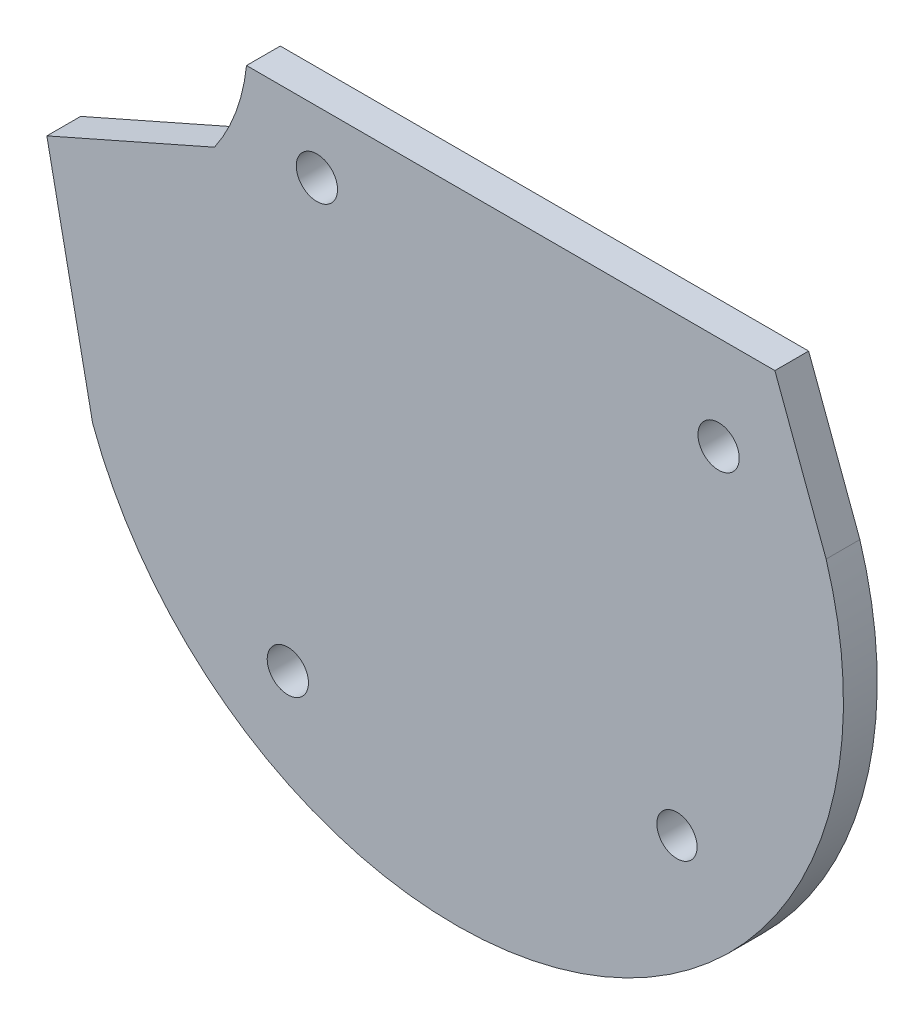
ISO-10303-21;
HEADER;
FILE_DESCRIPTION(('STEP AP214'),'2;1');
FILE_NAME('part.step','',(''),(''),'','','');
FILE_SCHEMA(('AUTOMOTIVE_DESIGN { 1 0 10303 214 1 1 1 1 }'));
ENDSEC;
DATA;
#1=APPLICATION_CONTEXT('core data for automotive mechanical design processes');
#2=APPLICATION_PROTOCOL_DEFINITION('international standard','automotive_design',2000,#1);
#3=PRODUCT_CONTEXT('',#1,'mechanical');
#4=PRODUCT('Part','Part','',(#3));
#5=PRODUCT_RELATED_PRODUCT_CATEGORY('part','',(#4));
#6=PRODUCT_DEFINITION_FORMATION('','',#4);
#7=PRODUCT_DEFINITION_CONTEXT('part definition',#1,'design');
#8=PRODUCT_DEFINITION('design','',#6,#7);
#9=PRODUCT_DEFINITION_SHAPE('','',#8);
#10=(LENGTH_UNIT() NAMED_UNIT(*) SI_UNIT(.MILLI.,.METRE.));
#11=(NAMED_UNIT(*) PLANE_ANGLE_UNIT() SI_UNIT($,.RADIAN.));
#12=(NAMED_UNIT(*) SI_UNIT($,.STERADIAN.) SOLID_ANGLE_UNIT());
#13=UNCERTAINTY_MEASURE_WITH_UNIT(LENGTH_MEASURE(1.E-05),#10,'distance_accuracy_value','');
#14=(GEOMETRIC_REPRESENTATION_CONTEXT(3) GLOBAL_UNCERTAINTY_ASSIGNED_CONTEXT((#13)) GLOBAL_UNIT_ASSIGNED_CONTEXT((#10,
#11,#12)) REPRESENTATION_CONTEXT('',''));
#15=CARTESIAN_POINT('',(0.,0.,0.));
#16=DIRECTION('',(0.,0.,1.));
#17=DIRECTION('',(1.,0.,0.));
#18=AXIS2_PLACEMENT_3D('',#15,#16,#17);
#19=CARTESIAN_POINT('',(3.9740812322332,17.199431679907,-2.286));
#20=DIRECTION('',(0.,0.,-1.));
#21=DIRECTION('',(-1.,0.,0.));
#22=AXIS2_PLACEMENT_3D('',#19,#20,#21);
#23=PLANE('',#22);
#24=CARTESIAN_POINT('',(18.9310412725264,3.71163363169514,-2.286));
#25=DIRECTION('',(0.,0.,-1.));
#26=DIRECTION('',(-1.,0.,0.));
#27=AXIS2_PLACEMENT_3D('',#24,#25,#26);
#28=CIRCLE('',#27,1.36221903365474);
#29=CARTESIAN_POINT('',(17.5688222388716,3.71163363169514,-2.286));
#30=VERTEX_POINT('',#29);
#31=EDGE_CURVE('E189',#30,#30,#28,.T.);
#32=ORIENTED_EDGE('',*,*,#31,.F.);
#33=EDGE_LOOP('',(#32));
#34=FACE_BOUND('',#33,.T.);
#35=CARTESIAN_POINT('',(21.7505816204853,27.9321294603715,-2.286));
#36=DIRECTION('',(0.,0.,-1.));
#37=DIRECTION('',(-1.,0.,0.));
#38=AXIS2_PLACEMENT_3D('',#35,#36,#37);
#39=CIRCLE('',#38,1.39700000000144);
#40=CARTESIAN_POINT('',(20.3535816204838,27.9321294603715,-2.286));
#41=VERTEX_POINT('',#40);
#42=EDGE_CURVE('E121',#41,#41,#39,.T.);
#43=ORIENTED_EDGE('',*,*,#42,.F.);
#44=EDGE_LOOP('',(#43));
#45=FACE_BOUND('',#44,.T.);
#46=DIRECTION('',(0.34877796767638,-0.937205382647547,0.));
#47=VECTOR('',#46,1.);
#48=CARTESIAN_POINT('',(25.5605816199512,34.2821294606921,-2.286));
#49=LINE('',#48,#47);
#50=CARTESIAN_POINT('',(25.5605816199512,34.2821294606921,-2.286));
#51=VERTEX_POINT('',#50);
#52=CARTESIAN_POINT('',(29.0285403943555,24.9633366142721,-2.286));
#53=VERTEX_POINT('',#52);
#54=EDGE_CURVE('E128',#51,#53,#49,.T.);
#55=ORIENTED_EDGE('',*,*,#54,.T.);
#56=CARTESIAN_POINT('',(3.9740812322332,17.199431679907,-2.286));
#57=DIRECTION('',(0.,0.,-1.));
#58=DIRECTION('',(-1.,0.,0.));
#59=AXIS2_PLACEMENT_3D('',#56,#57,#58);
#60=CIRCLE('',#59,26.229833086322);
#61=CARTESIAN_POINT('',(-20.6299682712623,8.10850808734212,-2.286));
#62=VERTEX_POINT('',#61);
#63=EDGE_CURVE('E86',#53,#62,#60,.T.);
#64=ORIENTED_EDGE('',*,*,#63,.T.);
#65=DIRECTION('',(-0.198505284294286,0.980099817420269,0.));
#66=VECTOR('',#65,1.);
#67=CARTESIAN_POINT('',(-23.7266606110478,23.3981141430225,-2.286));
#68=LINE('',#67,#66);
#69=CARTESIAN_POINT('',(-23.7266606110478,23.3981141430225,-2.286));
#70=VERTEX_POINT('',#69);
#71=EDGE_CURVE('E99',#62,#70,#68,.T.);
#72=ORIENTED_EDGE('',*,*,#71,.T.);
#73=DIRECTION('',(0.914846758610003,0.403801198934291,0.));
#74=VECTOR('',#73,1.);
#75=CARTESIAN_POINT('',(-12.3774095044088,28.4075227251005,-2.286));
#76=LINE('',#75,#74);
#77=CARTESIAN_POINT('',(-12.3774095044088,28.4075227251005,-2.286));
#78=VERTEX_POINT('',#77);
#79=EDGE_CURVE('E93',#70,#78,#76,.T.);
#80=ORIENTED_EDGE('',*,*,#79,.T.);
#81=CARTESIAN_POINT('',(-22.7937575549379,35.5888082569436,-2.286));
#82=DIRECTION('',(0.,0.,1.));
#83=DIRECTION('',(-1.,0.,0.));
#84=AXIS2_PLACEMENT_3D('',#81,#82,#83);
#85=CIRCLE('',#84,12.6519235138227);
#86=CARTESIAN_POINT('',(-10.209491222919,34.2821294576834,-2.286));
#87=VERTEX_POINT('',#86);
#88=EDGE_CURVE('E97',#78,#87,#85,.T.);
#89=ORIENTED_EDGE('',*,*,#88,.T.);
#90=DIRECTION('',(1.,8.41111723922713E-11,0.));
#91=VECTOR('',#90,1.);
#92=CARTESIAN_POINT('',(25.5605816199512,34.2821294606921,-2.286));
#93=LINE('',#92,#91);
#94=EDGE_CURVE('E49',#87,#51,#93,.T.);
#95=ORIENTED_EDGE('',*,*,#94,.T.);
#96=EDGE_LOOP('',(#55,#64,#72,#80,#89,#95));
#97=FACE_BOUND('',#96,.T.);
#98=CARTESIAN_POINT('',(-5.44454065001504,30.0847795749855,-2.286));
#99=DIRECTION('',(0.,0.,-1.));
#100=DIRECTION('',(-1.,0.,0.));
#101=AXIS2_PLACEMENT_3D('',#98,#99,#100);
#102=CIRCLE('',#101,1.39700000000141);
#103=CARTESIAN_POINT('',(-6.84154065001644,30.0847795749855,-2.286));
#104=VERTEX_POINT('',#103);
#105=EDGE_CURVE('E195',#104,#104,#102,.T.);
#106=ORIENTED_EDGE('',*,*,#105,.F.);
#107=EDGE_LOOP('',(#106));
#108=FACE_BOUND('',#107,.T.);
#109=CARTESIAN_POINT('',(-7.41242768109301,0.181665370216247,-2.286));
#110=DIRECTION('',(0.,0.,-1.));
#111=DIRECTION('',(-1.,0.,0.));
#112=AXIS2_PLACEMENT_3D('',#109,#110,#111);
#113=CIRCLE('',#112,1.3970000000008);
#114=CARTESIAN_POINT('',(-8.80942768109382,0.181665370216247,-2.286));
#115=VERTEX_POINT('',#114);
#116=EDGE_CURVE('E180',#115,#115,#113,.T.);
#117=ORIENTED_EDGE('',*,*,#116,.F.);
#118=EDGE_LOOP('',(#117));
#119=FACE_BOUND('',#118,.T.);
#120=ADVANCED_FACE('F32',(#34,#45,#97,#108,#119),#23,.T.);
#121=CARTESIAN_POINT('',(3.9740812322332,17.199431679907,0.));
#122=DIRECTION('',(0.,0.,-1.));
#123=DIRECTION('',(-1.,0.,0.));
#124=AXIS2_PLACEMENT_3D('',#121,#122,#123);
#125=PLANE('',#124);
#126=CARTESIAN_POINT('',(18.9310412725264,3.71163363169514,0.));
#127=DIRECTION('',(0.,0.,-1.));
#128=DIRECTION('',(-1.,0.,0.));
#129=AXIS2_PLACEMENT_3D('',#126,#127,#128);
#130=CIRCLE('',#129,1.36221903365474);
#131=CARTESIAN_POINT('',(17.5688222388716,3.71163363169514,0.));
#132=VERTEX_POINT('',#131);
#133=EDGE_CURVE('E186',#132,#132,#130,.T.);
#134=ORIENTED_EDGE('',*,*,#133,.T.);
#135=EDGE_LOOP('',(#134));
#136=FACE_BOUND('',#135,.T.);
#137=CARTESIAN_POINT('',(21.7505816204853,27.9321294603715,0.));
#138=DIRECTION('',(0.,0.,-1.));
#139=DIRECTION('',(-1.,0.,0.));
#140=AXIS2_PLACEMENT_3D('',#137,#138,#139);
#141=CIRCLE('',#140,1.39700000000144);
#142=CARTESIAN_POINT('',(20.3535816204838,27.9321294603715,0.));
#143=VERTEX_POINT('',#142);
#144=EDGE_CURVE('E198',#143,#143,#141,.T.);
#145=ORIENTED_EDGE('',*,*,#144,.T.);
#146=EDGE_LOOP('',(#145));
#147=FACE_BOUND('',#146,.T.);
#148=DIRECTION('',(0.34877796767638,-0.937205382647547,0.));
#149=VECTOR('',#148,1.);
#150=CARTESIAN_POINT('',(25.5605816199512,34.2821294606921,0.));
#151=LINE('',#150,#149);
#152=CARTESIAN_POINT('',(25.5605816199512,34.2821294606921,0.));
#153=VERTEX_POINT('',#152);
#154=CARTESIAN_POINT('',(29.0285403943555,24.9633366142721,0.));
#155=VERTEX_POINT('',#154);
#156=EDGE_CURVE('E117',#153,#155,#151,.T.);
#157=ORIENTED_EDGE('',*,*,#156,.F.);
#158=DIRECTION('',(1.,8.41111723922713E-11,0.));
#159=VECTOR('',#158,1.);
#160=CARTESIAN_POINT('',(25.5605816199512,34.2821294606921,0.));
#161=LINE('',#160,#159);
#162=CARTESIAN_POINT('',(-10.209491222919,34.2821294576834,0.));
#163=VERTEX_POINT('',#162);
#164=EDGE_CURVE('E78',#163,#153,#161,.T.);
#165=ORIENTED_EDGE('',*,*,#164,.F.);
#166=CARTESIAN_POINT('',(-22.7937575549379,35.5888082569436,0.));
#167=DIRECTION('',(0.,0.,1.));
#168=DIRECTION('',(-1.,0.,0.));
#169=AXIS2_PLACEMENT_3D('',#166,#167,#168);
#170=CIRCLE('',#169,12.6519235138227);
#171=CARTESIAN_POINT('',(-12.3774095044088,28.4075227251005,0.));
#172=VERTEX_POINT('',#171);
#173=EDGE_CURVE('E72',#172,#163,#170,.T.);
#174=ORIENTED_EDGE('',*,*,#173,.F.);
#175=DIRECTION('',(0.914846758610003,0.403801198934291,0.));
#176=VECTOR('',#175,1.);
#177=CARTESIAN_POINT('',(-12.3774095044088,28.4075227251005,0.));
#178=LINE('',#177,#176);
#179=CARTESIAN_POINT('',(-23.7266606110478,23.3981141430225,0.));
#180=VERTEX_POINT('',#179);
#181=EDGE_CURVE('E107',#180,#172,#178,.T.);
#182=ORIENTED_EDGE('',*,*,#181,.F.);
#183=DIRECTION('',(-0.198505284294286,0.980099817420269,0.));
#184=VECTOR('',#183,1.);
#185=CARTESIAN_POINT('',(-23.7266606110478,23.3981141430225,0.));
#186=LINE('',#185,#184);
#187=CARTESIAN_POINT('',(-20.6299682712623,8.10850808734212,0.));
#188=VERTEX_POINT('',#187);
#189=EDGE_CURVE('E123',#188,#180,#186,.T.);
#190=ORIENTED_EDGE('',*,*,#189,.F.);
#191=CARTESIAN_POINT('',(3.9740812322332,17.199431679907,0.));
#192=DIRECTION('',(0.,0.,-1.));
#193=DIRECTION('',(-1.,0.,0.));
#194=AXIS2_PLACEMENT_3D('',#191,#192,#193);
#195=CIRCLE('',#194,26.229833086322);
#196=EDGE_CURVE('E120',#155,#188,#195,.T.);
#197=ORIENTED_EDGE('',*,*,#196,.F.);
#198=EDGE_LOOP('',(#157,#165,#174,#182,#190,#197));
#199=FACE_BOUND('',#198,.T.);
#200=CARTESIAN_POINT('',(-5.44454065001504,30.0847795749855,0.));
#201=DIRECTION('',(0.,0.,-1.));
#202=DIRECTION('',(-1.,0.,0.));
#203=AXIS2_PLACEMENT_3D('',#200,#201,#202);
#204=CIRCLE('',#203,1.39700000000141);
#205=CARTESIAN_POINT('',(-6.84154065001644,30.0847795749855,0.));
#206=VERTEX_POINT('',#205);
#207=EDGE_CURVE('E192',#206,#206,#204,.T.);
#208=ORIENTED_EDGE('',*,*,#207,.T.);
#209=EDGE_LOOP('',(#208));
#210=FACE_BOUND('',#209,.T.);
#211=CARTESIAN_POINT('',(-7.41242768109301,0.181665370216247,0.));
#212=DIRECTION('',(0.,0.,-1.));
#213=DIRECTION('',(-1.,0.,0.));
#214=AXIS2_PLACEMENT_3D('',#211,#212,#213);
#215=CIRCLE('',#214,1.3970000000008);
#216=CARTESIAN_POINT('',(-8.80942768109382,0.181665370216247,0.));
#217=VERTEX_POINT('',#216);
#218=EDGE_CURVE('E183',#217,#217,#215,.T.);
#219=ORIENTED_EDGE('',*,*,#218,.T.);
#220=EDGE_LOOP('',(#219));
#221=FACE_BOUND('',#220,.T.);
#222=ADVANCED_FACE('F137',(#136,#147,#199,#210,#221),#125,.F.);
#223=CARTESIAN_POINT('',(25.5605816199512,34.2821294606921,-2.286));
#224=DIRECTION('',(-0.937205382647546,-0.34877796767638,0.));
#225=DIRECTION('',(0.34877796767638,-0.937205382647547,0.));
#226=AXIS2_PLACEMENT_3D('',#223,#224,#225);
#227=PLANE('',#226);
#228=ORIENTED_EDGE('',*,*,#156,.T.);
#229=DIRECTION('',(0.,0.,1.));
#230=VECTOR('',#229,1.);
#231=CARTESIAN_POINT('',(29.0285403943555,24.9633366142721,-2.286));
#232=LINE('',#231,#230);
#233=EDGE_CURVE('E11',#53,#155,#232,.T.);
#234=ORIENTED_EDGE('',*,*,#233,.F.);
#235=ORIENTED_EDGE('',*,*,#54,.F.);
#236=DIRECTION('',(0.,0.,1.));
#237=VECTOR('',#236,1.);
#238=CARTESIAN_POINT('',(25.5605816199512,34.2821294606921,-2.286));
#239=LINE('',#238,#237);
#240=EDGE_CURVE('E113',#51,#153,#239,.T.);
#241=ORIENTED_EDGE('',*,*,#240,.T.);
#242=EDGE_LOOP('',(#228,#234,#235,#241));
#243=FACE_BOUND('',#242,.T.);
#244=ADVANCED_FACE('F34',(#243),#227,.F.);
#245=CARTESIAN_POINT('',(3.9740812322332,17.199431679907,-2.286));
#246=DIRECTION('',(0.,0.,1.));
#247=DIRECTION('',(1.,0.,0.));
#248=AXIS2_PLACEMENT_3D('',#245,#246,#247);
#249=CYLINDRICAL_SURFACE('',#248,26.229833086322);
#250=ORIENTED_EDGE('',*,*,#196,.T.);
#251=DIRECTION('',(0.,0.,1.));
#252=VECTOR('',#251,1.);
#253=CARTESIAN_POINT('',(-20.6299682712623,8.10850808734212,-2.286));
#254=LINE('',#253,#252);
#255=EDGE_CURVE('E41',#62,#188,#254,.T.);
#256=ORIENTED_EDGE('',*,*,#255,.F.);
#257=ORIENTED_EDGE('',*,*,#63,.F.);
#258=ORIENTED_EDGE('',*,*,#233,.T.);
#259=EDGE_LOOP('',(#250,#256,#257,#258));
#260=FACE_BOUND('',#259,.T.);
#261=ADVANCED_FACE('F255',(#260),#249,.T.);
#262=CARTESIAN_POINT('',(-23.7266606110478,23.3981141430225,-2.286));
#263=DIRECTION('',(0.980099817420269,0.198505284294286,0.));
#264=DIRECTION('',(-0.198505284294286,0.980099817420269,0.));
#265=AXIS2_PLACEMENT_3D('',#262,#263,#264);
#266=PLANE('',#265);
#267=ORIENTED_EDGE('',*,*,#189,.T.);
#268=DIRECTION('',(0.,0.,1.));
#269=VECTOR('',#268,1.);
#270=CARTESIAN_POINT('',(-23.7266606110478,23.3981141430225,-2.286));
#271=LINE('',#270,#269);
#272=EDGE_CURVE('E108',#70,#180,#271,.T.);
#273=ORIENTED_EDGE('',*,*,#272,.F.);
#274=ORIENTED_EDGE('',*,*,#71,.F.);
#275=ORIENTED_EDGE('',*,*,#255,.T.);
#276=EDGE_LOOP('',(#267,#273,#274,#275));
#277=FACE_BOUND('',#276,.T.);
#278=ADVANCED_FACE('F134',(#277),#266,.F.);
#279=CARTESIAN_POINT('',(-12.3774095044088,28.4075227251005,-2.286));
#280=DIRECTION('',(0.403801198934291,-0.914846758610003,0.));
#281=DIRECTION('',(0.914846758610003,0.403801198934291,0.));
#282=AXIS2_PLACEMENT_3D('',#279,#280,#281);
#283=PLANE('',#282);
#284=ORIENTED_EDGE('',*,*,#181,.T.);
#285=DIRECTION('',(0.,0.,1.));
#286=VECTOR('',#285,1.);
#287=CARTESIAN_POINT('',(-12.3774095044088,28.4075227251005,-2.286));
#288=LINE('',#287,#286);
#289=EDGE_CURVE('E104',#78,#172,#288,.T.);
#290=ORIENTED_EDGE('',*,*,#289,.F.);
#291=ORIENTED_EDGE('',*,*,#79,.F.);
#292=ORIENTED_EDGE('',*,*,#272,.T.);
#293=EDGE_LOOP('',(#284,#290,#291,#292));
#294=FACE_BOUND('',#293,.T.);
#295=ADVANCED_FACE('F105',(#294),#283,.F.);
#296=CARTESIAN_POINT('',(-22.7937575549379,35.5888082569436,-2.286));
#297=DIRECTION('',(0.,0.,1.));
#298=DIRECTION('',(1.,0.,0.));
#299=AXIS2_PLACEMENT_3D('',#296,#297,#298);
#300=CYLINDRICAL_SURFACE('',#299,12.6519235138227);
#301=ORIENTED_EDGE('',*,*,#173,.T.);
#302=DIRECTION('',(0.,0.,1.));
#303=VECTOR('',#302,1.);
#304=CARTESIAN_POINT('',(-10.209491222919,34.2821294576834,-2.286));
#305=LINE('',#304,#303);
#306=EDGE_CURVE('E109',#87,#163,#305,.T.);
#307=ORIENTED_EDGE('',*,*,#306,.F.);
#308=ORIENTED_EDGE('',*,*,#88,.F.);
#309=ORIENTED_EDGE('',*,*,#289,.T.);
#310=EDGE_LOOP('',(#301,#307,#308,#309));
#311=FACE_BOUND('',#310,.T.);
#312=ADVANCED_FACE('F111',(#311),#300,.F.);
#313=CARTESIAN_POINT('',(25.5605816199512,34.2821294606921,-2.286));
#314=DIRECTION('',(8.41111723922713E-11,-1.,0.));
#315=DIRECTION('',(1.,8.41111723922713E-11,0.));
#316=AXIS2_PLACEMENT_3D('',#313,#314,#315);
#317=PLANE('',#316);
#318=ORIENTED_EDGE('',*,*,#164,.T.);
#319=ORIENTED_EDGE('',*,*,#240,.F.);
#320=ORIENTED_EDGE('',*,*,#94,.F.);
#321=ORIENTED_EDGE('',*,*,#306,.T.);
#322=EDGE_LOOP('',(#318,#319,#320,#321));
#323=FACE_BOUND('',#322,.T.);
#324=ADVANCED_FACE('F142',(#323),#317,.F.);
#325=CARTESIAN_POINT('',(21.7505816204853,27.9321294603715,-2.286));
#326=DIRECTION('',(0.,0.,1.));
#327=DIRECTION('',(1.,0.,0.));
#328=AXIS2_PLACEMENT_3D('',#325,#326,#327);
#329=CYLINDRICAL_SURFACE('',#328,1.39700000000144);
#330=ORIENTED_EDGE('',*,*,#42,.T.);
#331=EDGE_LOOP('',(#330));
#332=FACE_BOUND('',#331,.T.);
#333=ORIENTED_EDGE('',*,*,#144,.F.);
#334=EDGE_LOOP('',(#333));
#335=FACE_BOUND('',#334,.T.);
#336=ADVANCED_FACE('F144',(#332,#335),#329,.F.);
#337=CARTESIAN_POINT('',(-5.44454065001504,30.0847795749855,-2.286));
#338=DIRECTION('',(0.,0.,1.));
#339=DIRECTION('',(1.,0.,0.));
#340=AXIS2_PLACEMENT_3D('',#337,#338,#339);
#341=CYLINDRICAL_SURFACE('',#340,1.39700000000141);
#342=ORIENTED_EDGE('',*,*,#105,.T.);
#343=EDGE_LOOP('',(#342));
#344=FACE_BOUND('',#343,.T.);
#345=ORIENTED_EDGE('',*,*,#207,.F.);
#346=EDGE_LOOP('',(#345));
#347=FACE_BOUND('',#346,.T.);
#348=ADVANCED_FACE('F150',(#344,#347),#341,.F.);
#349=CARTESIAN_POINT('',(18.9310412725264,3.71163363169514,-2.286));
#350=DIRECTION('',(0.,0.,1.));
#351=DIRECTION('',(1.,0.,0.));
#352=AXIS2_PLACEMENT_3D('',#349,#350,#351);
#353=CYLINDRICAL_SURFACE('',#352,1.36221903365474);
#354=ORIENTED_EDGE('',*,*,#31,.T.);
#355=EDGE_LOOP('',(#354));
#356=FACE_BOUND('',#355,.T.);
#357=ORIENTED_EDGE('',*,*,#133,.F.);
#358=EDGE_LOOP('',(#357));
#359=FACE_BOUND('',#358,.T.);
#360=ADVANCED_FACE('F167',(#356,#359),#353,.F.);
#361=CARTESIAN_POINT('',(-7.41242768109301,0.181665370216247,-2.286));
#362=DIRECTION('',(0.,0.,1.));
#363=DIRECTION('',(1.,0.,0.));
#364=AXIS2_PLACEMENT_3D('',#361,#362,#363);
#365=CYLINDRICAL_SURFACE('',#364,1.3970000000008);
#366=ORIENTED_EDGE('',*,*,#116,.T.);
#367=EDGE_LOOP('',(#366));
#368=FACE_BOUND('',#367,.T.);
#369=ORIENTED_EDGE('',*,*,#218,.F.);
#370=EDGE_LOOP('',(#369));
#371=FACE_BOUND('',#370,.T.);
#372=ADVANCED_FACE('F171',(#368,#371),#365,.F.);
#373=CLOSED_SHELL('',(#120,#222,#244,#261,#278,#295,#312,#324,#336,#348,#360,#372));
#374=MANIFOLD_SOLID_BREP('B2',#373);
#375=ADVANCED_BREP_SHAPE_REPRESENTATION('',(#18,#374),#14);
#376=SHAPE_DEFINITION_REPRESENTATION(#9,#375);
ENDSEC;
END-ISO-10303-21;
